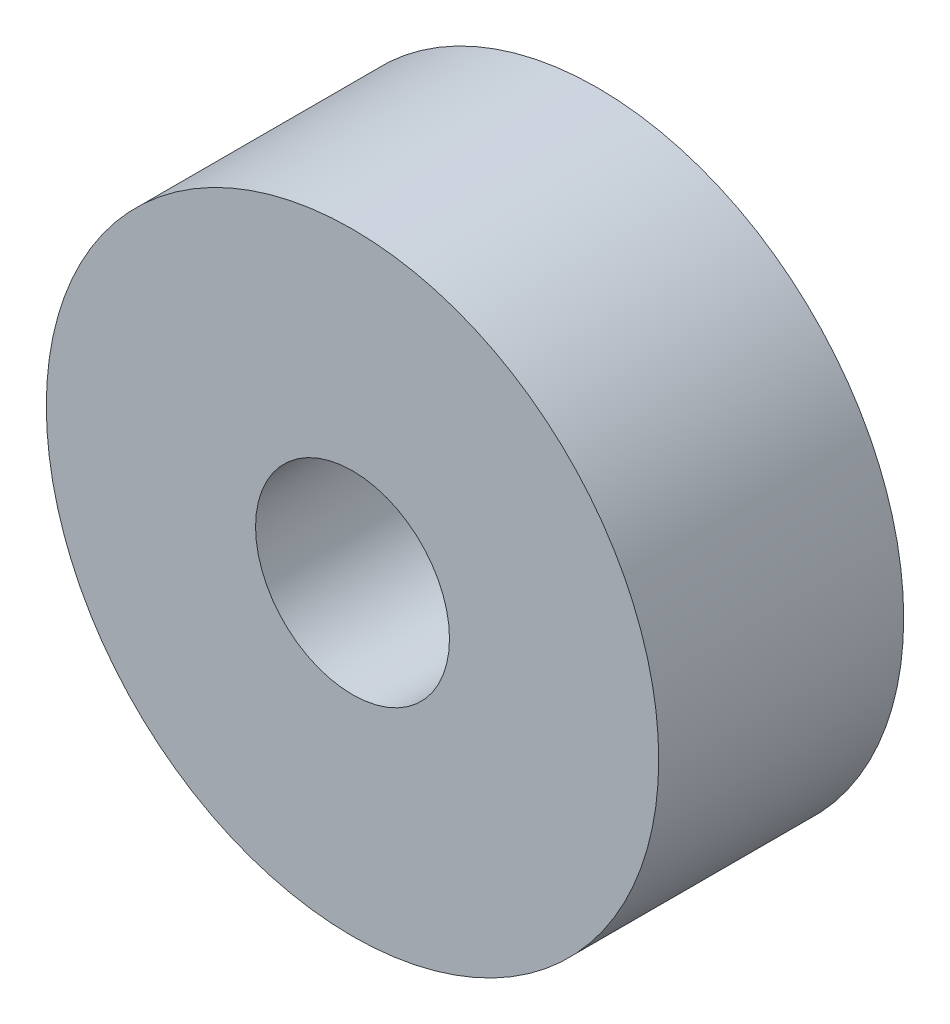
ISO-10303-21;
HEADER;
FILE_DESCRIPTION(('STEP AP214'),'2;1');
FILE_NAME('part.step','',(''),(''),'','','');
FILE_SCHEMA(('AUTOMOTIVE_DESIGN { 1 0 10303 214 1 1 1 1 }'));
ENDSEC;
DATA;
#1=APPLICATION_CONTEXT('core data for automotive mechanical design processes');
#2=APPLICATION_PROTOCOL_DEFINITION('international standard','automotive_design',2000,#1);
#3=PRODUCT_CONTEXT('',#1,'mechanical');
#4=PRODUCT('Part','Part','',(#3));
#5=PRODUCT_RELATED_PRODUCT_CATEGORY('part','',(#4));
#6=PRODUCT_DEFINITION_FORMATION('','',#4);
#7=PRODUCT_DEFINITION_CONTEXT('part definition',#1,'design');
#8=PRODUCT_DEFINITION('design','',#6,#7);
#9=PRODUCT_DEFINITION_SHAPE('','',#8);
#10=(LENGTH_UNIT() NAMED_UNIT(*) SI_UNIT(.MILLI.,.METRE.));
#11=(NAMED_UNIT(*) PLANE_ANGLE_UNIT() SI_UNIT($,.RADIAN.));
#12=(NAMED_UNIT(*) SI_UNIT($,.STERADIAN.) SOLID_ANGLE_UNIT());
#13=UNCERTAINTY_MEASURE_WITH_UNIT(LENGTH_MEASURE(1.E-05),#10,'distance_accuracy_value','');
#14=(GEOMETRIC_REPRESENTATION_CONTEXT(3) GLOBAL_UNCERTAINTY_ASSIGNED_CONTEXT((#13)) GLOBAL_UNIT_ASSIGNED_CONTEXT((#10,
#11,#12)) REPRESENTATION_CONTEXT('',''));
#15=CARTESIAN_POINT('',(0.,0.,0.));
#16=DIRECTION('',(0.,0.,1.));
#17=DIRECTION('',(1.,0.,0.));
#18=AXIS2_PLACEMENT_3D('',#15,#16,#17);
#19=CARTESIAN_POINT('',(0.,0.,12.));
#20=DIRECTION('',(0.,0.,1.));
#21=DIRECTION('',(1.,0.,0.));
#22=AXIS2_PLACEMENT_3D('',#19,#20,#21);
#23=PLANE('',#22);
#24=CARTESIAN_POINT('',(0.,0.,12.));
#25=DIRECTION('',(0.,0.,1.));
#26=DIRECTION('',(1.,0.,0.));
#27=AXIS2_PLACEMENT_3D('',#24,#25,#26);
#28=CIRCLE('',#27,15.);
#29=CARTESIAN_POINT('',(15.,0.,12.));
#30=VERTEX_POINT('',#29);
#31=EDGE_CURVE('E10',#30,#30,#28,.T.);
#32=ORIENTED_EDGE('',*,*,#31,.T.);
#33=EDGE_LOOP('',(#32));
#34=FACE_BOUND('',#33,.T.);
#35=CARTESIAN_POINT('',(0.,0.,12.));
#36=DIRECTION('',(0.,0.,1.));
#37=DIRECTION('',(1.,0.,0.));
#38=AXIS2_PLACEMENT_3D('',#35,#36,#37);
#39=CIRCLE('',#38,4.75);
#40=CARTESIAN_POINT('',(4.75,0.,12.));
#41=VERTEX_POINT('',#40);
#42=EDGE_CURVE('E52',#41,#41,#39,.T.);
#43=ORIENTED_EDGE('',*,*,#42,.F.);
#44=EDGE_LOOP('',(#43));
#45=FACE_BOUND('',#44,.T.);
#46=ADVANCED_FACE('F39',(#34,#45),#23,.T.);
#47=CARTESIAN_POINT('',(0.,0.,0.));
#48=DIRECTION('',(0.,0.,1.));
#49=DIRECTION('',(1.,0.,0.));
#50=AXIS2_PLACEMENT_3D('',#47,#48,#49);
#51=PLANE('',#50);
#52=CARTESIAN_POINT('',(0.,0.,0.));
#53=DIRECTION('',(0.,0.,1.));
#54=DIRECTION('',(1.,0.,0.));
#55=AXIS2_PLACEMENT_3D('',#52,#53,#54);
#56=CIRCLE('',#55,15.);
#57=CARTESIAN_POINT('',(15.,0.,0.));
#58=VERTEX_POINT('',#57);
#59=EDGE_CURVE('E43',#58,#58,#56,.T.);
#60=ORIENTED_EDGE('',*,*,#59,.F.);
#61=EDGE_LOOP('',(#60));
#62=FACE_BOUND('',#61,.T.);
#63=CARTESIAN_POINT('',(0.,0.,0.));
#64=DIRECTION('',(0.,0.,1.));
#65=DIRECTION('',(1.,0.,0.));
#66=AXIS2_PLACEMENT_3D('',#63,#64,#65);
#67=CIRCLE('',#66,4.75);
#68=CARTESIAN_POINT('',(4.75,0.,0.));
#69=VERTEX_POINT('',#68);
#70=EDGE_CURVE('E54',#69,#69,#67,.T.);
#71=ORIENTED_EDGE('',*,*,#70,.T.);
#72=EDGE_LOOP('',(#71));
#73=FACE_BOUND('',#72,.T.);
#74=ADVANCED_FACE('F66',(#62,#73),#51,.F.);
#75=CARTESIAN_POINT('',(0.,0.,12.));
#76=DIRECTION('',(0.,0.,-1.));
#77=DIRECTION('',(-1.,0.,0.));
#78=AXIS2_PLACEMENT_3D('',#75,#76,#77);
#79=CYLINDRICAL_SURFACE('',#78,15.);
#80=ORIENTED_EDGE('',*,*,#31,.F.);
#81=EDGE_LOOP('',(#80));
#82=FACE_BOUND('',#81,.T.);
#83=ORIENTED_EDGE('',*,*,#59,.T.);
#84=EDGE_LOOP('',(#83));
#85=FACE_BOUND('',#84,.T.);
#86=ADVANCED_FACE('F41',(#82,#85),#79,.T.);
#87=CARTESIAN_POINT('',(0.,0.,12.));
#88=DIRECTION('',(0.,0.,-1.));
#89=DIRECTION('',(-1.,0.,0.));
#90=AXIS2_PLACEMENT_3D('',#87,#88,#89);
#91=CYLINDRICAL_SURFACE('',#90,4.75);
#92=ORIENTED_EDGE('',*,*,#42,.T.);
#93=EDGE_LOOP('',(#92));
#94=FACE_BOUND('',#93,.T.);
#95=ORIENTED_EDGE('',*,*,#70,.F.);
#96=EDGE_LOOP('',(#95));
#97=FACE_BOUND('',#96,.T.);
#98=ADVANCED_FACE('F62',(#94,#97),#91,.F.);
#99=CLOSED_SHELL('',(#46,#74,#86,#98));
#100=MANIFOLD_SOLID_BREP('B2',#99);
#101=ADVANCED_BREP_SHAPE_REPRESENTATION('',(#18,#100),#14);
#102=SHAPE_DEFINITION_REPRESENTATION(#9,#101);
ENDSEC;
END-ISO-10303-21;
